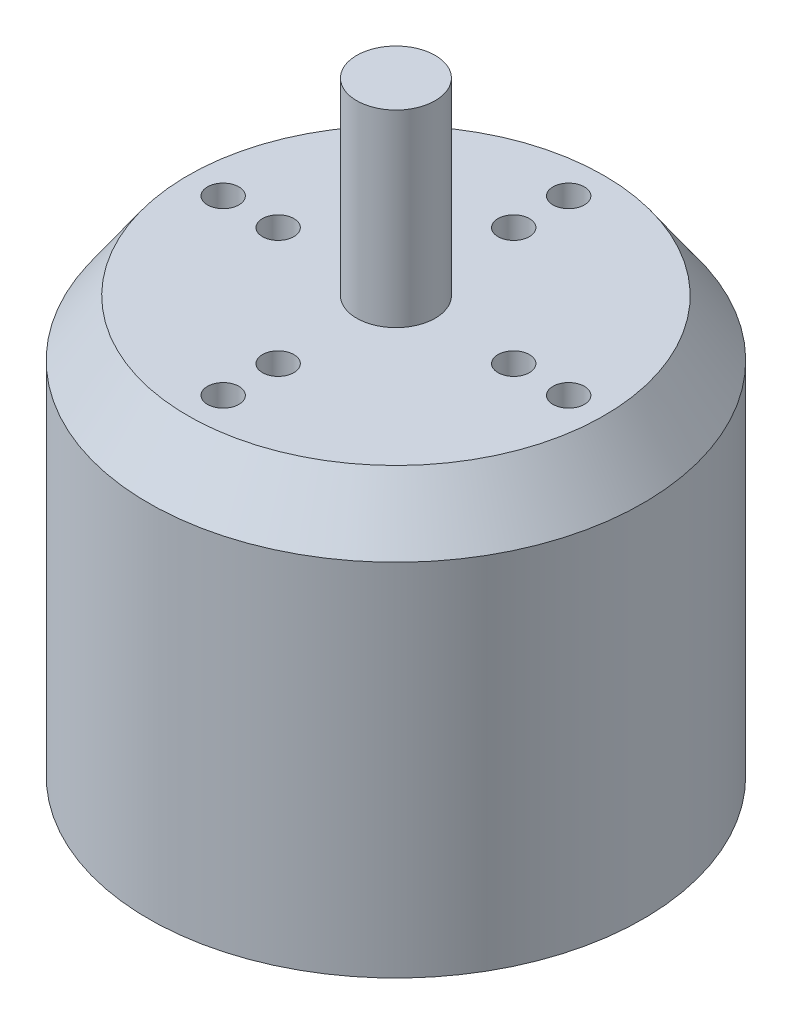
ISO-10303-21;
HEADER;
FILE_DESCRIPTION(('STEP AP214'),'2;1');
FILE_NAME('part.step','',(''),(''),'','','');
FILE_SCHEMA(('AUTOMOTIVE_DESIGN { 1 0 10303 214 1 1 1 1 }'));
ENDSEC;
DATA;
#1=APPLICATION_CONTEXT('core data for automotive mechanical design processes');
#2=APPLICATION_PROTOCOL_DEFINITION('international standard','automotive_design',2000,#1);
#3=PRODUCT_CONTEXT('',#1,'mechanical');
#4=PRODUCT('Part','Part','',(#3));
#5=PRODUCT_RELATED_PRODUCT_CATEGORY('part','',(#4));
#6=PRODUCT_DEFINITION_FORMATION('','',#4);
#7=PRODUCT_DEFINITION_CONTEXT('part definition',#1,'design');
#8=PRODUCT_DEFINITION('design','',#6,#7);
#9=PRODUCT_DEFINITION_SHAPE('','',#8);
#10=(LENGTH_UNIT() NAMED_UNIT(*) SI_UNIT(.MILLI.,.METRE.));
#11=(NAMED_UNIT(*) PLANE_ANGLE_UNIT() SI_UNIT($,.RADIAN.));
#12=(NAMED_UNIT(*) SI_UNIT($,.STERADIAN.) SOLID_ANGLE_UNIT());
#13=UNCERTAINTY_MEASURE_WITH_UNIT(LENGTH_MEASURE(1.E-05),#10,'distance_accuracy_value','');
#14=(GEOMETRIC_REPRESENTATION_CONTEXT(3) GLOBAL_UNCERTAINTY_ASSIGNED_CONTEXT((#13)) GLOBAL_UNIT_ASSIGNED_CONTEXT((#10,
#11,#12)) REPRESENTATION_CONTEXT('',''));
#15=CARTESIAN_POINT('',(0.,0.,0.));
#16=DIRECTION('',(0.,0.,1.));
#17=DIRECTION('',(1.,0.,0.));
#18=AXIS2_PLACEMENT_3D('',#15,#16,#17);
#19=CARTESIAN_POINT('',(0.,0.,0.));
#20=DIRECTION('',(0.,-1.,0.));
#21=DIRECTION('',(0.,0.,-1.));
#22=AXIS2_PLACEMENT_3D('',#19,#20,#21);
#23=PLANE('',#22);
#24=CARTESIAN_POINT('',(0.,0.,0.));
#25=DIRECTION('',(0.,-1.,0.));
#26=DIRECTION('',(0.,0.,-1.));
#27=AXIS2_PLACEMENT_3D('',#24,#25,#26);
#28=CIRCLE('',#27,28.6437039865158);
#29=CARTESIAN_POINT('',(0.,0.,-28.6437039865158));
#30=VERTEX_POINT('',#29);
#31=EDGE_CURVE('E47',#30,#30,#28,.T.);
#32=ORIENTED_EDGE('',*,*,#31,.T.);
#33=EDGE_LOOP('',(#32));
#34=FACE_BOUND('',#33,.T.);
#35=ADVANCED_FACE('F38',(#34),#23,.T.);
#36=CARTESIAN_POINT('',(0.,55.,0.));
#37=DIRECTION('',(0.,-1.,0.));
#38=DIRECTION('',(0.,0.,-1.));
#39=AXIS2_PLACEMENT_3D('',#36,#37,#38);
#40=CYLINDRICAL_SURFACE('',#39,31.5);
#41=CARTESIAN_POINT('',(0.,2.,0.));
#42=DIRECTION('',(0.,-1.,0.));
#43=DIRECTION('',(0.,0.,-1.));
#44=AXIS2_PLACEMENT_3D('',#41,#42,#43);
#45=CIRCLE('',#44,31.5);
#46=CARTESIAN_POINT('',(0.,2.,-31.5));
#47=VERTEX_POINT('',#46);
#48=EDGE_CURVE('E11',#47,#47,#45,.F.);
#49=ORIENTED_EDGE('',*,*,#48,.T.);
#50=EDGE_LOOP('',(#49));
#51=FACE_BOUND('',#50,.T.);
#52=CARTESIAN_POINT('',(0.,47.8592599662894,0.));
#53=DIRECTION('',(0.,-1.,0.));
#54=DIRECTION('',(0.,0.,-1.));
#55=AXIS2_PLACEMENT_3D('',#52,#53,#54);
#56=CIRCLE('',#55,31.5);
#57=CARTESIAN_POINT('',(0.,47.8592599662894,-31.5));
#58=VERTEX_POINT('',#57);
#59=EDGE_CURVE('E135',#58,#58,#56,.T.);
#60=ORIENTED_EDGE('',*,*,#59,.T.);
#61=EDGE_LOOP('',(#60));
#62=FACE_BOUND('',#61,.T.);
#63=ADVANCED_FACE('F158',(#51,#62),#40,.T.);
#64=CARTESIAN_POINT('',(0.,55.,0.));
#65=DIRECTION('',(0.,-1.,0.));
#66=DIRECTION('',(0.,0.,-1.));
#67=AXIS2_PLACEMENT_3D('',#64,#65,#66);
#68=PLANE('',#67);
#69=CARTESIAN_POINT('',(0.,55.,-22.));
#70=DIRECTION('',(0.,1.,0.));
#71=DIRECTION('',(0.,0.,1.));
#72=AXIS2_PLACEMENT_3D('',#69,#70,#71);
#73=CIRCLE('',#72,1.99999999999999);
#74=CARTESIAN_POINT('',(0.,55.,-20.));
#75=VERTEX_POINT('',#74);
#76=EDGE_CURVE('E83',#75,#75,#73,.T.);
#77=ORIENTED_EDGE('',*,*,#76,.F.);
#78=EDGE_LOOP('',(#77));
#79=FACE_BOUND('',#78,.T.);
#80=CARTESIAN_POINT('',(22.,55.,0.));
#81=DIRECTION('',(0.,1.,0.));
#82=DIRECTION('',(0.,0.,1.));
#83=AXIS2_PLACEMENT_3D('',#80,#81,#82);
#84=CIRCLE('',#83,1.99999999999999);
#85=CARTESIAN_POINT('',(22.,55.,1.99999999999999));
#86=VERTEX_POINT('',#85);
#87=EDGE_CURVE('E82',#86,#86,#84,.T.);
#88=ORIENTED_EDGE('',*,*,#87,.F.);
#89=EDGE_LOOP('',(#88));
#90=FACE_BOUND('',#89,.T.);
#91=CARTESIAN_POINT('',(0.,55.,22.));
#92=DIRECTION('',(0.,1.,0.));
#93=DIRECTION('',(0.,0.,1.));
#94=AXIS2_PLACEMENT_3D('',#91,#92,#93);
#95=CIRCLE('',#94,1.99999999999999);
#96=CARTESIAN_POINT('',(0.,55.,24.));
#97=VERTEX_POINT('',#96);
#98=EDGE_CURVE('E93',#97,#97,#95,.T.);
#99=ORIENTED_EDGE('',*,*,#98,.F.);
#100=EDGE_LOOP('',(#99));
#101=FACE_BOUND('',#100,.T.);
#102=CARTESIAN_POINT('',(-22.,55.,0.));
#103=DIRECTION('',(0.,1.,0.));
#104=DIRECTION('',(0.,0.,1.));
#105=AXIS2_PLACEMENT_3D('',#102,#103,#104);
#106=CIRCLE('',#105,1.99999999999999);
#107=CARTESIAN_POINT('',(-22.,55.,1.99999999999999));
#108=VERTEX_POINT('',#107);
#109=EDGE_CURVE('E99',#108,#108,#106,.T.);
#110=ORIENTED_EDGE('',*,*,#109,.F.);
#111=EDGE_LOOP('',(#110));
#112=FACE_BOUND('',#111,.T.);
#113=CARTESIAN_POINT('',(0.,55.,-15.));
#114=DIRECTION('',(0.,1.,0.));
#115=DIRECTION('',(0.,0.,1.));
#116=AXIS2_PLACEMENT_3D('',#113,#114,#115);
#117=CIRCLE('',#116,1.99999999999999);
#118=CARTESIAN_POINT('',(0.,55.,-13.));
#119=VERTEX_POINT('',#118);
#120=EDGE_CURVE('E105',#119,#119,#117,.T.);
#121=ORIENTED_EDGE('',*,*,#120,.F.);
#122=EDGE_LOOP('',(#121));
#123=FACE_BOUND('',#122,.T.);
#124=CARTESIAN_POINT('',(-15.,55.,0.));
#125=DIRECTION('',(0.,1.,0.));
#126=DIRECTION('',(0.,0.,1.));
#127=AXIS2_PLACEMENT_3D('',#124,#125,#126);
#128=CIRCLE('',#127,1.99999999999999);
#129=CARTESIAN_POINT('',(-15.,55.,1.99999999999999));
#130=VERTEX_POINT('',#129);
#131=EDGE_CURVE('E111',#130,#130,#128,.T.);
#132=ORIENTED_EDGE('',*,*,#131,.F.);
#133=EDGE_LOOP('',(#132));
#134=FACE_BOUND('',#133,.T.);
#135=CARTESIAN_POINT('',(0.,55.,15.));
#136=DIRECTION('',(0.,1.,0.));
#137=DIRECTION('',(0.,0.,1.));
#138=AXIS2_PLACEMENT_3D('',#135,#136,#137);
#139=CIRCLE('',#138,1.99999999999999);
#140=CARTESIAN_POINT('',(0.,55.,17.));
#141=VERTEX_POINT('',#140);
#142=EDGE_CURVE('E117',#141,#141,#139,.T.);
#143=ORIENTED_EDGE('',*,*,#142,.F.);
#144=EDGE_LOOP('',(#143));
#145=FACE_BOUND('',#144,.T.);
#146=CARTESIAN_POINT('',(15.,55.,0.));
#147=DIRECTION('',(0.,1.,0.));
#148=DIRECTION('',(0.,0.,1.));
#149=AXIS2_PLACEMENT_3D('',#146,#147,#148);
#150=CIRCLE('',#149,1.99999999999999);
#151=CARTESIAN_POINT('',(15.,55.,1.99999999999999));
#152=VERTEX_POINT('',#151);
#153=EDGE_CURVE('E123',#152,#152,#150,.T.);
#154=ORIENTED_EDGE('',*,*,#153,.F.);
#155=EDGE_LOOP('',(#154));
#156=FACE_BOUND('',#155,.T.);
#157=CARTESIAN_POINT('',(0.,55.,0.));
#158=DIRECTION('',(0.,-1.,0.));
#159=DIRECTION('',(0.,0.,-1.));
#160=AXIS2_PLACEMENT_3D('',#157,#158,#159);
#161=CIRCLE('',#160,26.5);
#162=CARTESIAN_POINT('',(0.,55.,-26.5));
#163=VERTEX_POINT('',#162);
#164=EDGE_CURVE('E138',#163,#163,#161,.F.);
#165=ORIENTED_EDGE('',*,*,#164,.T.);
#166=EDGE_LOOP('',(#165));
#167=FACE_BOUND('',#166,.T.);
#168=CARTESIAN_POINT('',(0.,55.,0.));
#169=DIRECTION('',(0.,-1.,0.));
#170=DIRECTION('',(0.,0.,-1.));
#171=AXIS2_PLACEMENT_3D('',#168,#169,#170);
#172=CIRCLE('',#171,5.);
#173=CARTESIAN_POINT('',(0.,55.,-5.));
#174=VERTEX_POINT('',#173);
#175=EDGE_CURVE('E132',#174,#174,#172,.T.);
#176=ORIENTED_EDGE('',*,*,#175,.T.);
#177=EDGE_LOOP('',(#176));
#178=FACE_BOUND('',#177,.T.);
#179=ADVANCED_FACE('F163',(#79,#90,#101,#112,#123,#134,#145,#156,#167,#178),#68,.F.);
#180=CARTESIAN_POINT('',(0.,55.,0.));
#181=DIRECTION('',(0.,-1.,0.));
#182=DIRECTION('',(0.,0.,-1.));
#183=AXIS2_PLACEMENT_3D('',#180,#181,#182);
#184=CYLINDRICAL_SURFACE('',#183,5.);
#185=CARTESIAN_POINT('',(0.,79.,0.));
#186=DIRECTION('',(0.,-1.,0.));
#187=DIRECTION('',(0.,0.,-1.));
#188=AXIS2_PLACEMENT_3D('',#185,#186,#187);
#189=CIRCLE('',#188,5.);
#190=CARTESIAN_POINT('',(0.,79.,-5.));
#191=VERTEX_POINT('',#190);
#192=EDGE_CURVE('E129',#191,#191,#189,.T.);
#193=ORIENTED_EDGE('',*,*,#192,.T.);
#194=EDGE_LOOP('',(#193));
#195=FACE_BOUND('',#194,.T.);
#196=ORIENTED_EDGE('',*,*,#175,.F.);
#197=EDGE_LOOP('',(#196));
#198=FACE_BOUND('',#197,.T.);
#199=ADVANCED_FACE('F174',(#195,#198),#184,.T.);
#200=CARTESIAN_POINT('',(0.,79.,0.));
#201=DIRECTION('',(0.,-1.,0.));
#202=DIRECTION('',(0.,0.,-1.));
#203=AXIS2_PLACEMENT_3D('',#200,#201,#202);
#204=PLANE('',#203);
#205=ORIENTED_EDGE('',*,*,#192,.F.);
#206=EDGE_LOOP('',(#205));
#207=FACE_BOUND('',#206,.T.);
#208=ADVANCED_FACE('F154',(#207),#204,.F.);
#209=CARTESIAN_POINT('',(0.,47.8592599662894,0.));
#210=DIRECTION('',(0.,-1.,0.));
#211=DIRECTION('',(0.,0.,-1.));
#212=AXIS2_PLACEMENT_3D('',#209,#210,#211);
#213=CONICAL_SURFACE('',#212,31.5,0.610865238198018);
#214=ORIENTED_EDGE('',*,*,#164,.F.);
#215=EDGE_LOOP('',(#214));
#216=FACE_BOUND('',#215,.T.);
#217=ORIENTED_EDGE('',*,*,#59,.F.);
#218=EDGE_LOOP('',(#217));
#219=FACE_BOUND('',#218,.T.);
#220=ADVANCED_FACE('F146',(#216,#219),#213,.T.);
#221=CARTESIAN_POINT('',(0.,0.,0.));
#222=DIRECTION('',(0.,1.,0.));
#223=DIRECTION('',(0.,0.,1.));
#224=AXIS2_PLACEMENT_3D('',#221,#222,#223);
#225=CONICAL_SURFACE('',#224,28.6437039865158,0.959931088596882);
#226=ORIENTED_EDGE('',*,*,#48,.F.);
#227=EDGE_LOOP('',(#226));
#228=FACE_BOUND('',#227,.T.);
#229=ORIENTED_EDGE('',*,*,#31,.F.);
#230=EDGE_LOOP('',(#229));
#231=FACE_BOUND('',#230,.T.);
#232=ADVANCED_FACE('F41',(#228,#231),#225,.T.);
#233=CARTESIAN_POINT('',(15.,35.,0.));
#234=DIRECTION('',(0.,1.,0.));
#235=DIRECTION('',(0.,0.,1.));
#236=AXIS2_PLACEMENT_3D('',#233,#234,#235);
#237=CONICAL_SURFACE('',#236,1.99999999999999,1.02974425867665);
#238=CARTESIAN_POINT('',(15.,33.7982787619449,0.));
#239=VERTEX_POINT('',#238);
#240=VERTEX_LOOP('',#239);
#241=FACE_BOUND('',#240,.T.);
#242=CARTESIAN_POINT('',(15.,35.,0.));
#243=DIRECTION('',(0.,1.,0.));
#244=DIRECTION('',(0.,0.,1.));
#245=AXIS2_PLACEMENT_3D('',#242,#243,#244);
#246=CIRCLE('',#245,1.99999999999999);
#247=CARTESIAN_POINT('',(15.,35.,1.99999999999999));
#248=VERTEX_POINT('',#247);
#249=EDGE_CURVE('E126',#248,#248,#246,.T.);
#250=ORIENTED_EDGE('',*,*,#249,.T.);
#251=EDGE_LOOP('',(#250));
#252=FACE_BOUND('',#251,.T.);
#253=ADVANCED_FACE('F145',(#241,#252),#237,.F.);
#254=CARTESIAN_POINT('',(15.,55.,0.));
#255=DIRECTION('',(0.,1.,0.));
#256=DIRECTION('',(0.,0.,1.));
#257=AXIS2_PLACEMENT_3D('',#254,#255,#256);
#258=CYLINDRICAL_SURFACE('',#257,1.99999999999999);
#259=ORIENTED_EDGE('',*,*,#249,.F.);
#260=EDGE_LOOP('',(#259));
#261=FACE_BOUND('',#260,.T.);
#262=ORIENTED_EDGE('',*,*,#153,.T.);
#263=EDGE_LOOP('',(#262));
#264=FACE_BOUND('',#263,.T.);
#265=ADVANCED_FACE('F152',(#261,#264),#258,.F.);
#266=CARTESIAN_POINT('',(0.,35.,15.));
#267=DIRECTION('',(0.,1.,0.));
#268=DIRECTION('',(0.,0.,1.));
#269=AXIS2_PLACEMENT_3D('',#266,#267,#268);
#270=CONICAL_SURFACE('',#269,1.99999999999999,1.02974425867665);
#271=CARTESIAN_POINT('',(0.,33.7982787619449,15.));
#272=VERTEX_POINT('',#271);
#273=VERTEX_LOOP('',#272);
#274=FACE_BOUND('',#273,.T.);
#275=CARTESIAN_POINT('',(0.,35.,15.));
#276=DIRECTION('',(0.,1.,0.));
#277=DIRECTION('',(0.,0.,1.));
#278=AXIS2_PLACEMENT_3D('',#275,#276,#277);
#279=CIRCLE('',#278,1.99999999999999);
#280=CARTESIAN_POINT('',(0.,35.,17.));
#281=VERTEX_POINT('',#280);
#282=EDGE_CURVE('E120',#281,#281,#279,.T.);
#283=ORIENTED_EDGE('',*,*,#282,.T.);
#284=EDGE_LOOP('',(#283));
#285=FACE_BOUND('',#284,.T.);
#286=ADVANCED_FACE('F184',(#274,#285),#270,.F.);
#287=CARTESIAN_POINT('',(0.,55.,15.));
#288=DIRECTION('',(0.,1.,0.));
#289=DIRECTION('',(0.,0.,1.));
#290=AXIS2_PLACEMENT_3D('',#287,#288,#289);
#291=CYLINDRICAL_SURFACE('',#290,1.99999999999999);
#292=ORIENTED_EDGE('',*,*,#282,.F.);
#293=EDGE_LOOP('',(#292));
#294=FACE_BOUND('',#293,.T.);
#295=ORIENTED_EDGE('',*,*,#142,.T.);
#296=EDGE_LOOP('',(#295));
#297=FACE_BOUND('',#296,.T.);
#298=ADVANCED_FACE('F188',(#294,#297),#291,.F.);
#299=CARTESIAN_POINT('',(-15.,35.,0.));
#300=DIRECTION('',(0.,1.,0.));
#301=DIRECTION('',(0.,0.,1.));
#302=AXIS2_PLACEMENT_3D('',#299,#300,#301);
#303=CONICAL_SURFACE('',#302,1.99999999999999,1.02974425867665);
#304=CARTESIAN_POINT('',(-15.,33.7982787619449,0.));
#305=VERTEX_POINT('',#304);
#306=VERTEX_LOOP('',#305);
#307=FACE_BOUND('',#306,.T.);
#308=CARTESIAN_POINT('',(-15.,35.,0.));
#309=DIRECTION('',(0.,1.,0.));
#310=DIRECTION('',(0.,0.,1.));
#311=AXIS2_PLACEMENT_3D('',#308,#309,#310);
#312=CIRCLE('',#311,1.99999999999999);
#313=CARTESIAN_POINT('',(-15.,35.,1.99999999999999));
#314=VERTEX_POINT('',#313);
#315=EDGE_CURVE('E114',#314,#314,#312,.T.);
#316=ORIENTED_EDGE('',*,*,#315,.T.);
#317=EDGE_LOOP('',(#316));
#318=FACE_BOUND('',#317,.T.);
#319=ADVANCED_FACE('F191',(#307,#318),#303,.F.);
#320=CARTESIAN_POINT('',(-15.,55.,0.));
#321=DIRECTION('',(0.,1.,0.));
#322=DIRECTION('',(0.,0.,1.));
#323=AXIS2_PLACEMENT_3D('',#320,#321,#322);
#324=CYLINDRICAL_SURFACE('',#323,1.99999999999999);
#325=ORIENTED_EDGE('',*,*,#315,.F.);
#326=EDGE_LOOP('',(#325));
#327=FACE_BOUND('',#326,.T.);
#328=ORIENTED_EDGE('',*,*,#131,.T.);
#329=EDGE_LOOP('',(#328));
#330=FACE_BOUND('',#329,.T.);
#331=ADVANCED_FACE('F195',(#327,#330),#324,.F.);
#332=CARTESIAN_POINT('',(0.,35.,-15.));
#333=DIRECTION('',(0.,1.,0.));
#334=DIRECTION('',(0.,0.,1.));
#335=AXIS2_PLACEMENT_3D('',#332,#333,#334);
#336=CONICAL_SURFACE('',#335,1.99999999999999,1.02974425867665);
#337=CARTESIAN_POINT('',(0.,33.7982787619449,-15.));
#338=VERTEX_POINT('',#337);
#339=VERTEX_LOOP('',#338);
#340=FACE_BOUND('',#339,.T.);
#341=CARTESIAN_POINT('',(0.,35.,-15.));
#342=DIRECTION('',(0.,1.,0.));
#343=DIRECTION('',(0.,0.,1.));
#344=AXIS2_PLACEMENT_3D('',#341,#342,#343);
#345=CIRCLE('',#344,1.99999999999999);
#346=CARTESIAN_POINT('',(0.,35.,-13.));
#347=VERTEX_POINT('',#346);
#348=EDGE_CURVE('E108',#347,#347,#345,.T.);
#349=ORIENTED_EDGE('',*,*,#348,.T.);
#350=EDGE_LOOP('',(#349));
#351=FACE_BOUND('',#350,.T.);
#352=ADVANCED_FACE('F199',(#340,#351),#336,.F.);
#353=CARTESIAN_POINT('',(0.,55.,-15.));
#354=DIRECTION('',(0.,1.,0.));
#355=DIRECTION('',(0.,0.,1.));
#356=AXIS2_PLACEMENT_3D('',#353,#354,#355);
#357=CYLINDRICAL_SURFACE('',#356,1.99999999999999);
#358=ORIENTED_EDGE('',*,*,#348,.F.);
#359=EDGE_LOOP('',(#358));
#360=FACE_BOUND('',#359,.T.);
#361=ORIENTED_EDGE('',*,*,#120,.T.);
#362=EDGE_LOOP('',(#361));
#363=FACE_BOUND('',#362,.T.);
#364=ADVANCED_FACE('F203',(#360,#363),#357,.F.);
#365=CARTESIAN_POINT('',(-22.,35.,0.));
#366=DIRECTION('',(0.,1.,0.));
#367=DIRECTION('',(0.,0.,1.));
#368=AXIS2_PLACEMENT_3D('',#365,#366,#367);
#369=CONICAL_SURFACE('',#368,1.99999999999999,1.02974425867665);
#370=CARTESIAN_POINT('',(-22.,33.7982787619449,0.));
#371=VERTEX_POINT('',#370);
#372=VERTEX_LOOP('',#371);
#373=FACE_BOUND('',#372,.T.);
#374=CARTESIAN_POINT('',(-22.,35.,0.));
#375=DIRECTION('',(0.,1.,0.));
#376=DIRECTION('',(0.,0.,1.));
#377=AXIS2_PLACEMENT_3D('',#374,#375,#376);
#378=CIRCLE('',#377,1.99999999999999);
#379=CARTESIAN_POINT('',(-22.,35.,1.99999999999999));
#380=VERTEX_POINT('',#379);
#381=EDGE_CURVE('E102',#380,#380,#378,.T.);
#382=ORIENTED_EDGE('',*,*,#381,.T.);
#383=EDGE_LOOP('',(#382));
#384=FACE_BOUND('',#383,.T.);
#385=ADVANCED_FACE('F207',(#373,#384),#369,.F.);
#386=CARTESIAN_POINT('',(-22.,55.,0.));
#387=DIRECTION('',(0.,1.,0.));
#388=DIRECTION('',(0.,0.,1.));
#389=AXIS2_PLACEMENT_3D('',#386,#387,#388);
#390=CYLINDRICAL_SURFACE('',#389,1.99999999999999);
#391=ORIENTED_EDGE('',*,*,#381,.F.);
#392=EDGE_LOOP('',(#391));
#393=FACE_BOUND('',#392,.T.);
#394=ORIENTED_EDGE('',*,*,#109,.T.);
#395=EDGE_LOOP('',(#394));
#396=FACE_BOUND('',#395,.T.);
#397=ADVANCED_FACE('F211',(#393,#396),#390,.F.);
#398=CARTESIAN_POINT('',(0.,35.,22.));
#399=DIRECTION('',(0.,1.,0.));
#400=DIRECTION('',(0.,0.,1.));
#401=AXIS2_PLACEMENT_3D('',#398,#399,#400);
#402=CONICAL_SURFACE('',#401,1.99999999999999,1.02974425867665);
#403=CARTESIAN_POINT('',(0.,33.7982787619449,22.));
#404=VERTEX_POINT('',#403);
#405=VERTEX_LOOP('',#404);
#406=FACE_BOUND('',#405,.T.);
#407=CARTESIAN_POINT('',(0.,35.,22.));
#408=DIRECTION('',(0.,1.,0.));
#409=DIRECTION('',(0.,0.,1.));
#410=AXIS2_PLACEMENT_3D('',#407,#408,#409);
#411=CIRCLE('',#410,1.99999999999999);
#412=CARTESIAN_POINT('',(0.,35.,24.));
#413=VERTEX_POINT('',#412);
#414=EDGE_CURVE('E96',#413,#413,#411,.T.);
#415=ORIENTED_EDGE('',*,*,#414,.T.);
#416=EDGE_LOOP('',(#415));
#417=FACE_BOUND('',#416,.T.);
#418=ADVANCED_FACE('F215',(#406,#417),#402,.F.);
#419=CARTESIAN_POINT('',(0.,55.,22.));
#420=DIRECTION('',(0.,1.,0.));
#421=DIRECTION('',(0.,0.,1.));
#422=AXIS2_PLACEMENT_3D('',#419,#420,#421);
#423=CYLINDRICAL_SURFACE('',#422,1.99999999999999);
#424=ORIENTED_EDGE('',*,*,#414,.F.);
#425=EDGE_LOOP('',(#424));
#426=FACE_BOUND('',#425,.T.);
#427=ORIENTED_EDGE('',*,*,#98,.T.);
#428=EDGE_LOOP('',(#427));
#429=FACE_BOUND('',#428,.T.);
#430=ADVANCED_FACE('F219',(#426,#429),#423,.F.);
#431=CARTESIAN_POINT('',(22.,35.,0.));
#432=DIRECTION('',(0.,1.,0.));
#433=DIRECTION('',(0.,0.,1.));
#434=AXIS2_PLACEMENT_3D('',#431,#432,#433);
#435=CONICAL_SURFACE('',#434,1.99999999999999,1.02974425867665);
#436=CARTESIAN_POINT('',(22.,33.7982787619449,0.));
#437=VERTEX_POINT('',#436);
#438=VERTEX_LOOP('',#437);
#439=FACE_BOUND('',#438,.T.);
#440=CARTESIAN_POINT('',(22.,35.,0.));
#441=DIRECTION('',(0.,1.,0.));
#442=DIRECTION('',(0.,0.,1.));
#443=AXIS2_PLACEMENT_3D('',#440,#441,#442);
#444=CIRCLE('',#443,1.99999999999999);
#445=CARTESIAN_POINT('',(22.,35.,1.99999999999999));
#446=VERTEX_POINT('',#445);
#447=EDGE_CURVE('E86',#446,#446,#444,.T.);
#448=ORIENTED_EDGE('',*,*,#447,.T.);
#449=EDGE_LOOP('',(#448));
#450=FACE_BOUND('',#449,.T.);
#451=ADVANCED_FACE('F223',(#439,#450),#435,.F.);
#452=CARTESIAN_POINT('',(22.,55.,0.));
#453=DIRECTION('',(0.,1.,0.));
#454=DIRECTION('',(0.,0.,1.));
#455=AXIS2_PLACEMENT_3D('',#452,#453,#454);
#456=CYLINDRICAL_SURFACE('',#455,1.99999999999999);
#457=ORIENTED_EDGE('',*,*,#447,.F.);
#458=EDGE_LOOP('',(#457));
#459=FACE_BOUND('',#458,.T.);
#460=ORIENTED_EDGE('',*,*,#87,.T.);
#461=EDGE_LOOP('',(#460));
#462=FACE_BOUND('',#461,.T.);
#463=ADVANCED_FACE('F76',(#459,#462),#456,.F.);
#464=CARTESIAN_POINT('',(0.,35.,-22.));
#465=DIRECTION('',(0.,1.,0.));
#466=DIRECTION('',(0.,0.,1.));
#467=AXIS2_PLACEMENT_3D('',#464,#465,#466);
#468=CONICAL_SURFACE('',#467,1.99999999999999,1.02974425867665);
#469=CARTESIAN_POINT('',(0.,33.7982787619449,-22.));
#470=VERTEX_POINT('',#469);
#471=VERTEX_LOOP('',#470);
#472=FACE_BOUND('',#471,.T.);
#473=CARTESIAN_POINT('',(0.,35.,-22.));
#474=DIRECTION('',(0.,1.,0.));
#475=DIRECTION('',(0.,0.,1.));
#476=AXIS2_PLACEMENT_3D('',#473,#474,#475);
#477=CIRCLE('',#476,1.99999999999999);
#478=CARTESIAN_POINT('',(0.,35.,-20.));
#479=VERTEX_POINT('',#478);
#480=EDGE_CURVE('E80',#479,#479,#477,.T.);
#481=ORIENTED_EDGE('',*,*,#480,.T.);
#482=EDGE_LOOP('',(#481));
#483=FACE_BOUND('',#482,.T.);
#484=ADVANCED_FACE('F72',(#472,#483),#468,.F.);
#485=CARTESIAN_POINT('',(0.,55.,-22.));
#486=DIRECTION('',(0.,1.,0.));
#487=DIRECTION('',(0.,0.,1.));
#488=AXIS2_PLACEMENT_3D('',#485,#486,#487);
#489=CYLINDRICAL_SURFACE('',#488,1.99999999999999);
#490=ORIENTED_EDGE('',*,*,#480,.F.);
#491=EDGE_LOOP('',(#490));
#492=FACE_BOUND('',#491,.T.);
#493=ORIENTED_EDGE('',*,*,#76,.T.);
#494=EDGE_LOOP('',(#493));
#495=FACE_BOUND('',#494,.T.);
#496=ADVANCED_FACE('F75',(#492,#495),#489,.F.);
#497=CLOSED_SHELL('',(#35,#63,#179,#199,#208,#220,#232,#253,#265,#286,#298,#319,#331,#352,#364,
#385,#397,#418,#430,#451,#463,#484,#496));
#498=MANIFOLD_SOLID_BREP('B2',#497);
#499=ADVANCED_BREP_SHAPE_REPRESENTATION('',(#18,#498),#14);
#500=SHAPE_DEFINITION_REPRESENTATION(#9,#499);
ENDSEC;
END-ISO-10303-21;
